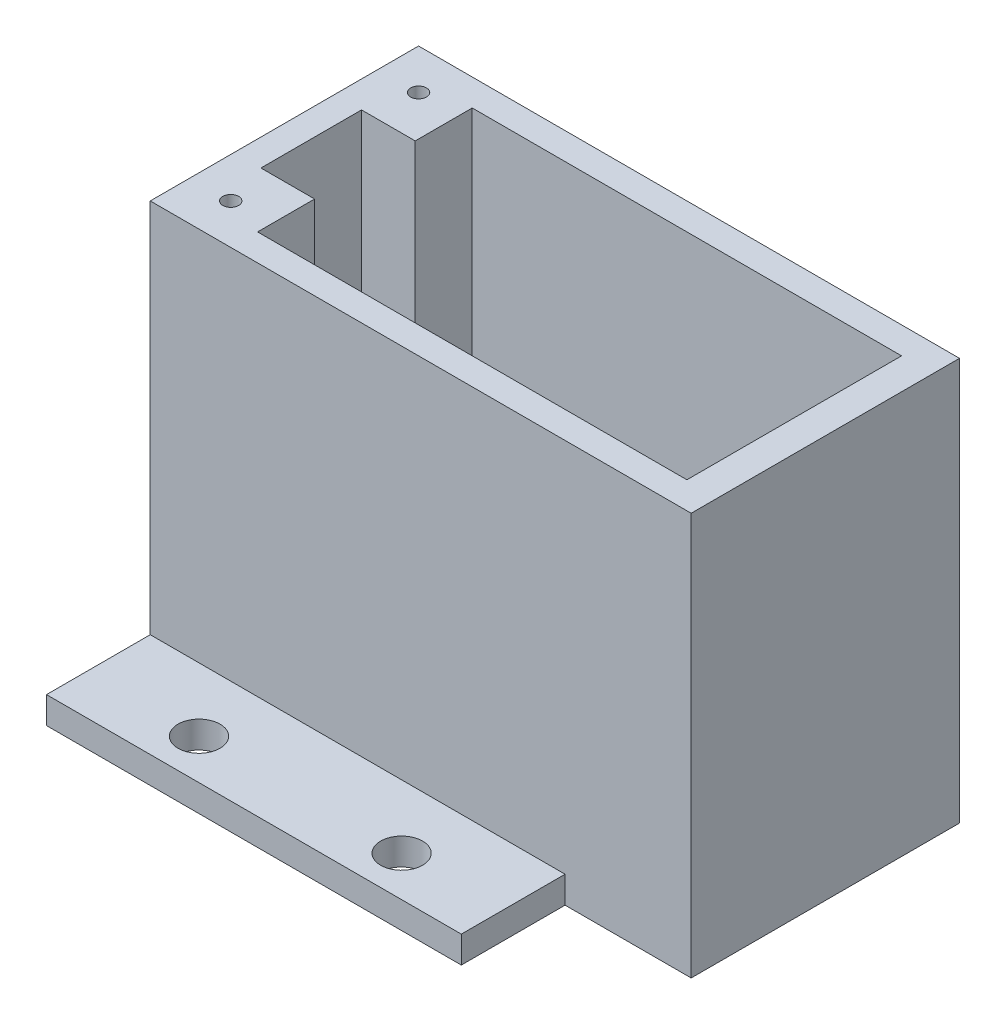
ISO-10303-21;
HEADER;
FILE_DESCRIPTION(('STEP AP214'),'2;1');
FILE_NAME('part.step','',(''),(''),'','','');
FILE_SCHEMA(('AUTOMOTIVE_DESIGN { 1 0 10303 214 1 1 1 1 }'));
ENDSEC;
DATA;
#1=APPLICATION_CONTEXT('core data for automotive mechanical design processes');
#2=APPLICATION_PROTOCOL_DEFINITION('international standard','automotive_design',2000,#1);
#3=PRODUCT_CONTEXT('',#1,'mechanical');
#4=PRODUCT('Part','Part','',(#3));
#5=PRODUCT_RELATED_PRODUCT_CATEGORY('part','',(#4));
#6=PRODUCT_DEFINITION_FORMATION('','',#4);
#7=PRODUCT_DEFINITION_CONTEXT('part definition',#1,'design');
#8=PRODUCT_DEFINITION('design','',#6,#7);
#9=PRODUCT_DEFINITION_SHAPE('','',#8);
#10=(LENGTH_UNIT() NAMED_UNIT(*) SI_UNIT(.MILLI.,.METRE.));
#11=(NAMED_UNIT(*) PLANE_ANGLE_UNIT() SI_UNIT($,.RADIAN.));
#12=(NAMED_UNIT(*) SI_UNIT($,.STERADIAN.) SOLID_ANGLE_UNIT());
#13=UNCERTAINTY_MEASURE_WITH_UNIT(LENGTH_MEASURE(1.E-05),#10,'distance_accuracy_value','');
#14=(GEOMETRIC_REPRESENTATION_CONTEXT(3) GLOBAL_UNCERTAINTY_ASSIGNED_CONTEXT((#13)) GLOBAL_UNIT_ASSIGNED_CONTEXT((#10,
#11,#12)) REPRESENTATION_CONTEXT('',''));
#15=CARTESIAN_POINT('',(0.,0.,0.));
#16=DIRECTION('',(0.,0.,1.));
#17=DIRECTION('',(1.,0.,0.));
#18=AXIS2_PLACEMENT_3D('',#15,#16,#17);
#19=CARTESIAN_POINT('',(0.,5.08,0.));
#20=DIRECTION('',(0.,1.,0.));
#21=DIRECTION('',(0.,0.,1.));
#22=AXIS2_PLACEMENT_3D('',#19,#20,#21);
#23=PLANE('',#22);
#24=DIRECTION('',(0.,0.,-1.));
#25=VECTOR('',#24,1.);
#26=CARTESIAN_POINT('',(-32.941,5.08,45.));
#27=LINE('',#26,#25);
#28=CARTESIAN_POINT('',(-32.941,5.08,45.));
#29=VERTEX_POINT('',#28);
#30=CARTESIAN_POINT('',(-32.941,5.08,25.358));
#31=VERTEX_POINT('',#30);
#32=EDGE_CURVE('E234',#29,#31,#27,.T.);
#33=ORIENTED_EDGE('',*,*,#32,.F.);
#34=DIRECTION('',(1.,0.,0.));
#35=VECTOR('',#34,1.);
#36=CARTESIAN_POINT('',(45.593,5.08,45.));
#37=LINE('',#36,#35);
#38=CARTESIAN_POINT('',(45.593,5.08,45.));
#39=VERTEX_POINT('',#38);
#40=EDGE_CURVE('E99',#29,#39,#37,.T.);
#41=ORIENTED_EDGE('',*,*,#40,.T.);
#42=DIRECTION('',(0.,0.,-1.));
#43=VECTOR('',#42,1.);
#44=CARTESIAN_POINT('',(45.593,5.08,45.));
#45=LINE('',#44,#43);
#46=CARTESIAN_POINT('',(45.593,5.08,25.358));
#47=VERTEX_POINT('',#46);
#48=EDGE_CURVE('E107',#39,#47,#45,.T.);
#49=ORIENTED_EDGE('',*,*,#48,.T.);
#50=DIRECTION('',(1.,0.,0.));
#51=VECTOR('',#50,1.);
#52=CARTESIAN_POINT('',(69.469,5.08,25.358));
#53=LINE('',#52,#51);
#54=EDGE_CURVE('E146',#31,#47,#53,.T.);
#55=ORIENTED_EDGE('',*,*,#54,.F.);
#56=EDGE_LOOP('',(#33,#41,#49,#55));
#57=FACE_BOUND('',#56,.T.);
#58=CARTESIAN_POINT('',(-11.684,5.08,37.38));
#59=DIRECTION('',(0.,1.,0.));
#60=DIRECTION('',(0.,0.,1.));
#61=AXIS2_PLACEMENT_3D('',#58,#59,#60);
#62=CIRCLE('',#61,3.96875);
#63=CARTESIAN_POINT('',(-11.684,5.08,41.34875));
#64=VERTEX_POINT('',#63);
#65=EDGE_CURVE('E113',#64,#64,#62,.T.);
#66=ORIENTED_EDGE('',*,*,#65,.F.);
#67=EDGE_LOOP('',(#66));
#68=FACE_BOUND('',#67,.T.);
#69=CARTESIAN_POINT('',(26.67,5.08,37.38));
#70=DIRECTION('',(0.,1.,0.));
#71=DIRECTION('',(0.,0.,1.));
#72=AXIS2_PLACEMENT_3D('',#69,#70,#71);
#73=CIRCLE('',#72,3.96875);
#74=CARTESIAN_POINT('',(26.67,5.08,41.34875));
#75=VERTEX_POINT('',#74);
#76=EDGE_CURVE('E105',#75,#75,#73,.T.);
#77=ORIENTED_EDGE('',*,*,#76,.F.);
#78=EDGE_LOOP('',(#77));
#79=FACE_BOUND('',#78,.T.);
#80=ADVANCED_FACE('F33',(#57,#68,#79),#23,.T.);
#81=CARTESIAN_POINT('',(45.593,5.08,45.));
#82=DIRECTION('',(-1.,0.,0.));
#83=DIRECTION('',(0.,0.,1.));
#84=AXIS2_PLACEMENT_3D('',#81,#82,#83);
#85=PLANE('',#84);
#86=DIRECTION('',(0.,1.,0.));
#87=VECTOR('',#86,1.);
#88=CARTESIAN_POINT('',(45.593,0.,25.358));
#89=LINE('',#88,#87);
#90=CARTESIAN_POINT('',(45.593,0.,25.358));
#91=VERTEX_POINT('',#90);
#92=EDGE_CURVE('E205',#91,#47,#89,.T.);
#93=ORIENTED_EDGE('',*,*,#92,.T.);
#94=ORIENTED_EDGE('',*,*,#48,.F.);
#95=DIRECTION('',(0.,-1.,0.));
#96=VECTOR('',#95,1.);
#97=CARTESIAN_POINT('',(45.593,5.08,45.));
#98=LINE('',#97,#96);
#99=CARTESIAN_POINT('',(45.593,0.,45.));
#100=VERTEX_POINT('',#99);
#101=EDGE_CURVE('E37',#39,#100,#98,.T.);
#102=ORIENTED_EDGE('',*,*,#101,.T.);
#103=DIRECTION('',(0.,0.,-1.));
#104=VECTOR('',#103,1.);
#105=CARTESIAN_POINT('',(45.593,0.,45.));
#106=LINE('',#105,#104);
#107=EDGE_CURVE('E83',#100,#91,#106,.T.);
#108=ORIENTED_EDGE('',*,*,#107,.T.);
#109=EDGE_LOOP('',(#93,#94,#102,#108));
#110=FACE_BOUND('',#109,.T.);
#111=ADVANCED_FACE('F357',(#110),#85,.F.);
#112=DIRECTION('',(0.,1.,0.));
#113=VECTOR('',#112,1.);
#114=CARTESIAN_POINT('',(45.593,0.,-25.442));
#115=LINE('',#114,#113);
#116=CARTESIAN_POINT('',(45.593,0.,-25.442));
#117=VERTEX_POINT('',#116);
#118=CARTESIAN_POINT('',(45.593,5.08,-25.442));
#119=VERTEX_POINT('',#118);
#120=EDGE_CURVE('E79',#117,#119,#115,.T.);
#121=ORIENTED_EDGE('',*,*,#120,.F.);
#122=CARTESIAN_POINT('',(45.593,0.,-45.));
#123=VERTEX_POINT('',#122);
#124=EDGE_CURVE('E72',#117,#123,#106,.T.);
#125=ORIENTED_EDGE('',*,*,#124,.T.);
#126=DIRECTION('',(0.,-1.,0.));
#127=VECTOR('',#126,1.);
#128=CARTESIAN_POINT('',(45.593,5.08,-45.));
#129=LINE('',#128,#127);
#130=CARTESIAN_POINT('',(45.593,5.08,-45.));
#131=VERTEX_POINT('',#130);
#132=EDGE_CURVE('E75',#131,#123,#129,.T.);
#133=ORIENTED_EDGE('',*,*,#132,.F.);
#134=EDGE_CURVE('E58',#119,#131,#45,.T.);
#135=ORIENTED_EDGE('',*,*,#134,.F.);
#136=EDGE_LOOP('',(#121,#125,#133,#135));
#137=FACE_BOUND('',#136,.T.);
#138=ADVANCED_FACE('F74',(#137),#85,.F.);
#139=CARTESIAN_POINT('',(-32.941,5.08,-25.442));
#140=VERTEX_POINT('',#139);
#141=CARTESIAN_POINT('',(-32.941,5.08,-45.));
#142=VERTEX_POINT('',#141);
#143=EDGE_CURVE('E237',#140,#142,#27,.T.);
#144=ORIENTED_EDGE('',*,*,#143,.F.);
#145=DIRECTION('',(-1.,0.,0.));
#146=VECTOR('',#145,1.);
#147=CARTESIAN_POINT('',(69.469,5.08,-25.442));
#148=LINE('',#147,#146);
#149=EDGE_CURVE('E11',#119,#140,#148,.T.);
#150=ORIENTED_EDGE('',*,*,#149,.F.);
#151=ORIENTED_EDGE('',*,*,#134,.T.);
#152=DIRECTION('',(-1.,0.,0.));
#153=VECTOR('',#152,1.);
#154=CARTESIAN_POINT('',(45.593,5.08,-45.));
#155=LINE('',#154,#153);
#156=EDGE_CURVE('E92',#131,#142,#155,.T.);
#157=ORIENTED_EDGE('',*,*,#156,.T.);
#158=EDGE_LOOP('',(#144,#150,#151,#157));
#159=FACE_BOUND('',#158,.T.);
#160=CARTESIAN_POINT('',(-11.684,5.08,-37.38));
#161=DIRECTION('',(0.,1.,0.));
#162=DIRECTION('',(0.,0.,1.));
#163=AXIS2_PLACEMENT_3D('',#160,#161,#162);
#164=CIRCLE('',#163,3.96875);
#165=CARTESIAN_POINT('',(-11.684,5.08,-33.41125));
#166=VERTEX_POINT('',#165);
#167=EDGE_CURVE('E119',#166,#166,#164,.T.);
#168=ORIENTED_EDGE('',*,*,#167,.F.);
#169=EDGE_LOOP('',(#168));
#170=FACE_BOUND('',#169,.T.);
#171=CARTESIAN_POINT('',(26.67,5.08,-37.38));
#172=DIRECTION('',(0.,1.,0.));
#173=DIRECTION('',(0.,0.,1.));
#174=AXIS2_PLACEMENT_3D('',#171,#172,#173);
#175=CIRCLE('',#174,3.96875);
#176=CARTESIAN_POINT('',(26.67,5.08,-33.41125));
#177=VERTEX_POINT('',#176);
#178=EDGE_CURVE('E125',#177,#177,#175,.T.);
#179=ORIENTED_EDGE('',*,*,#178,.F.);
#180=EDGE_LOOP('',(#179));
#181=FACE_BOUND('',#180,.T.);
#182=ADVANCED_FACE('F332',(#159,#170,#181),#23,.T.);
#183=CARTESIAN_POINT('',(0.,0.,0.));
#184=DIRECTION('',(0.,1.,0.));
#185=DIRECTION('',(0.,0.,1.));
#186=AXIS2_PLACEMENT_3D('',#183,#184,#185);
#187=PLANE('',#186);
#188=DIRECTION('',(0.,0.,-1.));
#189=VECTOR('',#188,1.);
#190=CARTESIAN_POINT('',(63.579,0.,20.278));
#191=LINE('',#190,#189);
#192=CARTESIAN_POINT('',(63.579,0.,20.278));
#193=VERTEX_POINT('',#192);
#194=CARTESIAN_POINT('',(63.579,0.,-20.362));
#195=VERTEX_POINT('',#194);
#196=EDGE_CURVE('E239',#193,#195,#191,.T.);
#197=ORIENTED_EDGE('',*,*,#196,.T.);
#198=DIRECTION('',(-1.,0.,0.));
#199=VECTOR('',#198,1.);
#200=CARTESIAN_POINT('',(63.579,0.,-20.362));
#201=LINE('',#200,#199);
#202=CARTESIAN_POINT('',(-17.701,0.,-20.362));
#203=VERTEX_POINT('',#202);
#204=EDGE_CURVE('E260',#195,#203,#201,.T.);
#205=ORIENTED_EDGE('',*,*,#204,.T.);
#206=DIRECTION('',(0.,0.,1.));
#207=VECTOR('',#206,1.);
#208=CARTESIAN_POINT('',(-17.701,0.,-20.362));
#209=LINE('',#208,#207);
#210=CARTESIAN_POINT('',(-17.701,0.,-9.56699999999999));
#211=VERTEX_POINT('',#210);
#212=EDGE_CURVE('E257',#203,#211,#209,.T.);
#213=ORIENTED_EDGE('',*,*,#212,.T.);
#214=DIRECTION('',(-1.,0.,0.));
#215=VECTOR('',#214,1.);
#216=CARTESIAN_POINT('',(-17.701,0.,-9.56699999999999));
#217=LINE('',#216,#215);
#218=CARTESIAN_POINT('',(-27.861,0.,-9.56699999999999));
#219=VERTEX_POINT('',#218);
#220=EDGE_CURVE('E254',#211,#219,#217,.T.);
#221=ORIENTED_EDGE('',*,*,#220,.T.);
#222=DIRECTION('',(0.,0.,1.));
#223=VECTOR('',#222,1.);
#224=CARTESIAN_POINT('',(-27.861,0.,-9.56699999999999));
#225=LINE('',#224,#223);
#226=CARTESIAN_POINT('',(-27.861,0.,9.48300000000002));
#227=VERTEX_POINT('',#226);
#228=EDGE_CURVE('E251',#219,#227,#225,.T.);
#229=ORIENTED_EDGE('',*,*,#228,.T.);
#230=DIRECTION('',(1.,0.,0.));
#231=VECTOR('',#230,1.);
#232=CARTESIAN_POINT('',(-27.861,0.,9.48300000000002));
#233=LINE('',#232,#231);
#234=CARTESIAN_POINT('',(-17.701,0.,9.48300000000001));
#235=VERTEX_POINT('',#234);
#236=EDGE_CURVE('E248',#227,#235,#233,.T.);
#237=ORIENTED_EDGE('',*,*,#236,.T.);
#238=DIRECTION('',(0.,0.,1.));
#239=VECTOR('',#238,1.);
#240=CARTESIAN_POINT('',(-17.701,0.,9.48300000000001));
#241=LINE('',#240,#239);
#242=CARTESIAN_POINT('',(-17.701,0.,20.278));
#243=VERTEX_POINT('',#242);
#244=EDGE_CURVE('E245',#235,#243,#241,.T.);
#245=ORIENTED_EDGE('',*,*,#244,.T.);
#246=DIRECTION('',(1.,0.,0.));
#247=VECTOR('',#246,1.);
#248=CARTESIAN_POINT('',(-17.701,0.,20.278));
#249=LINE('',#248,#247);
#250=EDGE_CURVE('E242',#243,#193,#249,.T.);
#251=ORIENTED_EDGE('',*,*,#250,.T.);
#252=EDGE_LOOP('',(#197,#205,#213,#221,#229,#237,#245,#251));
#253=FACE_BOUND('',#252,.T.);
#254=DIRECTION('',(1.,0.,0.));
#255=VECTOR('',#254,1.);
#256=CARTESIAN_POINT('',(45.593,0.,45.));
#257=LINE('',#256,#255);
#258=CARTESIAN_POINT('',(-32.941,0.,45.));
#259=VERTEX_POINT('',#258);
#260=EDGE_CURVE('E84',#259,#100,#257,.T.);
#261=ORIENTED_EDGE('',*,*,#260,.F.);
#262=DIRECTION('',(0.,0.,-1.));
#263=VECTOR('',#262,1.);
#264=CARTESIAN_POINT('',(-32.941,0.,45.));
#265=LINE('',#264,#263);
#266=CARTESIAN_POINT('',(-32.941,0.,-45.));
#267=VERTEX_POINT('',#266);
#268=EDGE_CURVE('E98',#259,#267,#265,.T.);
#269=ORIENTED_EDGE('',*,*,#268,.T.);
#270=DIRECTION('',(-1.,0.,0.));
#271=VECTOR('',#270,1.);
#272=CARTESIAN_POINT('',(45.593,0.,-45.));
#273=LINE('',#272,#271);
#274=EDGE_CURVE('E91',#123,#267,#273,.T.);
#275=ORIENTED_EDGE('',*,*,#274,.F.);
#276=ORIENTED_EDGE('',*,*,#124,.F.);
#277=DIRECTION('',(1.,0.,0.));
#278=VECTOR('',#277,1.);
#279=CARTESIAN_POINT('',(69.469,0.,-25.442));
#280=LINE('',#279,#278);
#281=CARTESIAN_POINT('',(69.469,0.,-25.442));
#282=VERTEX_POINT('',#281);
#283=EDGE_CURVE('E209',#117,#282,#280,.T.);
#284=ORIENTED_EDGE('',*,*,#283,.T.);
#285=DIRECTION('',(0.,0.,1.));
#286=VECTOR('',#285,1.);
#287=CARTESIAN_POINT('',(69.469,0.,-25.442));
#288=LINE('',#287,#286);
#289=CARTESIAN_POINT('',(69.469,0.,25.358));
#290=VERTEX_POINT('',#289);
#291=EDGE_CURVE('E214',#282,#290,#288,.T.);
#292=ORIENTED_EDGE('',*,*,#291,.T.);
#293=DIRECTION('',(-1.,0.,0.));
#294=VECTOR('',#293,1.);
#295=CARTESIAN_POINT('',(69.469,0.,25.358));
#296=LINE('',#295,#294);
#297=EDGE_CURVE('E211',#290,#91,#296,.T.);
#298=ORIENTED_EDGE('',*,*,#297,.T.);
#299=ORIENTED_EDGE('',*,*,#107,.F.);
#300=EDGE_LOOP('',(#261,#269,#275,#276,#284,#292,#298,#299));
#301=FACE_BOUND('',#300,.T.);
#302=CARTESIAN_POINT('',(26.67,0.,37.38));
#303=DIRECTION('',(0.,1.,0.));
#304=DIRECTION('',(0.,0.,1.));
#305=AXIS2_PLACEMENT_3D('',#302,#303,#304);
#306=CIRCLE('',#305,3.96875);
#307=CARTESIAN_POINT('',(26.67,0.,41.34875));
#308=VERTEX_POINT('',#307);
#309=EDGE_CURVE('E110',#308,#308,#306,.T.);
#310=ORIENTED_EDGE('',*,*,#309,.T.);
#311=EDGE_LOOP('',(#310));
#312=FACE_BOUND('',#311,.T.);
#313=CARTESIAN_POINT('',(-11.684,0.,37.38));
#314=DIRECTION('',(0.,1.,0.));
#315=DIRECTION('',(0.,0.,1.));
#316=AXIS2_PLACEMENT_3D('',#313,#314,#315);
#317=CIRCLE('',#316,3.96875);
#318=CARTESIAN_POINT('',(-11.684,0.,41.34875));
#319=VERTEX_POINT('',#318);
#320=EDGE_CURVE('E116',#319,#319,#317,.T.);
#321=ORIENTED_EDGE('',*,*,#320,.T.);
#322=EDGE_LOOP('',(#321));
#323=FACE_BOUND('',#322,.T.);
#324=CARTESIAN_POINT('',(-11.684,0.,-37.38));
#325=DIRECTION('',(0.,1.,0.));
#326=DIRECTION('',(0.,0.,1.));
#327=AXIS2_PLACEMENT_3D('',#324,#325,#326);
#328=CIRCLE('',#327,3.96875);
#329=CARTESIAN_POINT('',(-11.684,0.,-33.41125));
#330=VERTEX_POINT('',#329);
#331=EDGE_CURVE('E122',#330,#330,#328,.T.);
#332=ORIENTED_EDGE('',*,*,#331,.T.);
#333=EDGE_LOOP('',(#332));
#334=FACE_BOUND('',#333,.T.);
#335=CARTESIAN_POINT('',(26.67,0.,-37.38));
#336=DIRECTION('',(0.,1.,0.));
#337=DIRECTION('',(0.,0.,1.));
#338=AXIS2_PLACEMENT_3D('',#335,#336,#337);
#339=CIRCLE('',#338,3.96875);
#340=CARTESIAN_POINT('',(26.67,0.,-33.41125));
#341=VERTEX_POINT('',#340);
#342=EDGE_CURVE('E128',#341,#341,#339,.T.);
#343=ORIENTED_EDGE('',*,*,#342,.T.);
#344=EDGE_LOOP('',(#343));
#345=FACE_BOUND('',#344,.T.);
#346=ADVANCED_FACE('F95',(#253,#301,#312,#323,#334,#345),#187,.F.);
#347=CARTESIAN_POINT('',(45.593,5.08,45.));
#348=DIRECTION('',(0.,0.,-1.));
#349=DIRECTION('',(-1.,0.,0.));
#350=AXIS2_PLACEMENT_3D('',#347,#348,#349);
#351=PLANE('',#350);
#352=ORIENTED_EDGE('',*,*,#40,.F.);
#353=DIRECTION('',(0.,1.,0.));
#354=VECTOR('',#353,1.);
#355=CARTESIAN_POINT('',(-32.941,0.,45.));
#356=LINE('',#355,#354);
#357=EDGE_CURVE('E230',#259,#29,#356,.T.);
#358=ORIENTED_EDGE('',*,*,#357,.F.);
#359=ORIENTED_EDGE('',*,*,#260,.T.);
#360=ORIENTED_EDGE('',*,*,#101,.F.);
#361=EDGE_LOOP('',(#352,#358,#359,#360));
#362=FACE_BOUND('',#361,.T.);
#363=ADVANCED_FACE('F35',(#362),#351,.F.);
#364=CARTESIAN_POINT('',(45.593,5.08,-45.));
#365=DIRECTION('',(0.,0.,1.));
#366=DIRECTION('',(1.,0.,0.));
#367=AXIS2_PLACEMENT_3D('',#364,#365,#366);
#368=PLANE('',#367);
#369=ORIENTED_EDGE('',*,*,#274,.T.);
#370=DIRECTION('',(0.,1.,0.));
#371=VECTOR('',#370,1.);
#372=CARTESIAN_POINT('',(-32.941,0.,-45.));
#373=LINE('',#372,#371);
#374=EDGE_CURVE('E222',#267,#142,#373,.T.);
#375=ORIENTED_EDGE('',*,*,#374,.T.);
#376=ORIENTED_EDGE('',*,*,#156,.F.);
#377=ORIENTED_EDGE('',*,*,#132,.T.);
#378=EDGE_LOOP('',(#369,#375,#376,#377));
#379=FACE_BOUND('',#378,.T.);
#380=ADVANCED_FACE('F88',(#379),#368,.F.);
#381=CARTESIAN_POINT('',(26.67,5.08,37.38));
#382=DIRECTION('',(0.,-1.,0.));
#383=DIRECTION('',(0.,0.,-1.));
#384=AXIS2_PLACEMENT_3D('',#381,#382,#383);
#385=CYLINDRICAL_SURFACE('',#384,3.96875);
#386=ORIENTED_EDGE('',*,*,#76,.T.);
#387=EDGE_LOOP('',(#386));
#388=FACE_BOUND('',#387,.T.);
#389=ORIENTED_EDGE('',*,*,#309,.F.);
#390=EDGE_LOOP('',(#389));
#391=FACE_BOUND('',#390,.T.);
#392=ADVANCED_FACE('F371',(#388,#391),#385,.F.);
#393=CARTESIAN_POINT('',(-11.684,5.08,37.38));
#394=DIRECTION('',(0.,-1.,0.));
#395=DIRECTION('',(0.,0.,-1.));
#396=AXIS2_PLACEMENT_3D('',#393,#394,#395);
#397=CYLINDRICAL_SURFACE('',#396,3.96875);
#398=ORIENTED_EDGE('',*,*,#65,.T.);
#399=EDGE_LOOP('',(#398));
#400=FACE_BOUND('',#399,.T.);
#401=ORIENTED_EDGE('',*,*,#320,.F.);
#402=EDGE_LOOP('',(#401));
#403=FACE_BOUND('',#402,.T.);
#404=ADVANCED_FACE('F374',(#400,#403),#397,.F.);
#405=CARTESIAN_POINT('',(-11.684,5.08,-37.38));
#406=DIRECTION('',(0.,-1.,0.));
#407=DIRECTION('',(0.,0.,-1.));
#408=AXIS2_PLACEMENT_3D('',#405,#406,#407);
#409=CYLINDRICAL_SURFACE('',#408,3.96875);
#410=ORIENTED_EDGE('',*,*,#167,.T.);
#411=EDGE_LOOP('',(#410));
#412=FACE_BOUND('',#411,.T.);
#413=ORIENTED_EDGE('',*,*,#331,.F.);
#414=EDGE_LOOP('',(#413));
#415=FACE_BOUND('',#414,.T.);
#416=ADVANCED_FACE('F388',(#412,#415),#409,.F.);
#417=CARTESIAN_POINT('',(26.67,5.08,-37.38));
#418=DIRECTION('',(0.,-1.,0.));
#419=DIRECTION('',(0.,0.,-1.));
#420=AXIS2_PLACEMENT_3D('',#417,#418,#419);
#421=CYLINDRICAL_SURFACE('',#420,3.96875);
#422=ORIENTED_EDGE('',*,*,#178,.T.);
#423=EDGE_LOOP('',(#422));
#424=FACE_BOUND('',#423,.T.);
#425=ORIENTED_EDGE('',*,*,#342,.F.);
#426=EDGE_LOOP('',(#425));
#427=FACE_BOUND('',#426,.T.);
#428=ADVANCED_FACE('F386',(#424,#427),#421,.F.);
#429=CARTESIAN_POINT('',(0.,76.2,0.));
#430=DIRECTION('',(0.,1.,0.));
#431=DIRECTION('',(0.,0.,1.));
#432=AXIS2_PLACEMENT_3D('',#429,#430,#431);
#433=PLANE('',#432);
#434=CARTESIAN_POINT('',(-25.321,76.2,-17.822));
#435=DIRECTION('',(0.,1.,0.));
#436=DIRECTION('',(0.,0.,1.));
#437=AXIS2_PLACEMENT_3D('',#434,#435,#436);
#438=CIRCLE('',#437,1.5);
#439=CARTESIAN_POINT('',(-25.321,76.2,-16.322));
#440=VERTEX_POINT('',#439);
#441=EDGE_CURVE('E225',#440,#440,#438,.T.);
#442=ORIENTED_EDGE('',*,*,#441,.F.);
#443=EDGE_LOOP('',(#442));
#444=FACE_BOUND('',#443,.T.);
#445=CARTESIAN_POINT('',(-25.321,76.2,17.738));
#446=DIRECTION('',(0.,1.,0.));
#447=DIRECTION('',(0.,0.,1.));
#448=AXIS2_PLACEMENT_3D('',#445,#446,#447);
#449=CIRCLE('',#448,1.5);
#450=CARTESIAN_POINT('',(-25.321,76.2,19.238));
#451=VERTEX_POINT('',#450);
#452=EDGE_CURVE('E218',#451,#451,#449,.T.);
#453=ORIENTED_EDGE('',*,*,#452,.F.);
#454=EDGE_LOOP('',(#453));
#455=FACE_BOUND('',#454,.T.);
#456=DIRECTION('',(0.,0.,1.));
#457=VECTOR('',#456,1.);
#458=CARTESIAN_POINT('',(-32.941,76.2,25.358));
#459=LINE('',#458,#457);
#460=CARTESIAN_POINT('',(-32.941,76.2,-25.442));
#461=VERTEX_POINT('',#460);
#462=CARTESIAN_POINT('',(-32.941,76.2,25.358));
#463=VERTEX_POINT('',#462);
#464=EDGE_CURVE('E149',#461,#463,#459,.T.);
#465=ORIENTED_EDGE('',*,*,#464,.T.);
#466=DIRECTION('',(1.,0.,0.));
#467=VECTOR('',#466,1.);
#468=CARTESIAN_POINT('',(69.469,76.2,25.358));
#469=LINE('',#468,#467);
#470=CARTESIAN_POINT('',(69.469,76.2,25.358));
#471=VERTEX_POINT('',#470);
#472=EDGE_CURVE('E156',#463,#471,#469,.T.);
#473=ORIENTED_EDGE('',*,*,#472,.T.);
#474=DIRECTION('',(0.,0.,-1.));
#475=VECTOR('',#474,1.);
#476=CARTESIAN_POINT('',(69.469,76.2,25.358));
#477=LINE('',#476,#475);
#478=CARTESIAN_POINT('',(69.469,76.2,-25.442));
#479=VERTEX_POINT('',#478);
#480=EDGE_CURVE('E153',#471,#479,#477,.T.);
#481=ORIENTED_EDGE('',*,*,#480,.T.);
#482=DIRECTION('',(-1.,0.,0.));
#483=VECTOR('',#482,1.);
#484=CARTESIAN_POINT('',(69.469,76.2,-25.442));
#485=LINE('',#484,#483);
#486=EDGE_CURVE('E144',#479,#461,#485,.T.);
#487=ORIENTED_EDGE('',*,*,#486,.T.);
#488=EDGE_LOOP('',(#465,#473,#481,#487));
#489=FACE_BOUND('',#488,.T.);
#490=DIRECTION('',(1.,0.,0.));
#491=VECTOR('',#490,1.);
#492=CARTESIAN_POINT('',(-17.701,76.2,9.48300000000001));
#493=LINE('',#492,#491);
#494=CARTESIAN_POINT('',(-27.861,76.2,9.48300000000002));
#495=VERTEX_POINT('',#494);
#496=CARTESIAN_POINT('',(-17.701,76.2,9.48300000000001));
#497=VERTEX_POINT('',#496);
#498=EDGE_CURVE('E199',#495,#497,#493,.T.);
#499=ORIENTED_EDGE('',*,*,#498,.F.);
#500=DIRECTION('',(0.,0.,1.));
#501=VECTOR('',#500,1.);
#502=CARTESIAN_POINT('',(-27.861,76.2,9.48300000000002));
#503=LINE('',#502,#501);
#504=CARTESIAN_POINT('',(-27.861,76.2,-9.56699999999999));
#505=VERTEX_POINT('',#504);
#506=EDGE_CURVE('E202',#505,#495,#503,.T.);
#507=ORIENTED_EDGE('',*,*,#506,.F.);
#508=DIRECTION('',(-1.,0.,0.));
#509=VECTOR('',#508,1.);
#510=CARTESIAN_POINT('',(-17.701,76.2,-9.56699999999999));
#511=LINE('',#510,#509);
#512=CARTESIAN_POINT('',(-17.701,76.2,-9.56699999999999));
#513=VERTEX_POINT('',#512);
#514=EDGE_CURVE('E182',#513,#505,#511,.T.);
#515=ORIENTED_EDGE('',*,*,#514,.F.);
#516=DIRECTION('',(0.,0.,1.));
#517=VECTOR('',#516,1.);
#518=CARTESIAN_POINT('',(-17.701,76.2,-9.56699999999999));
#519=LINE('',#518,#517);
#520=CARTESIAN_POINT('',(-17.701,76.2,-20.362));
#521=VERTEX_POINT('',#520);
#522=EDGE_CURVE('E185',#521,#513,#519,.T.);
#523=ORIENTED_EDGE('',*,*,#522,.F.);
#524=DIRECTION('',(-1.,0.,0.));
#525=VECTOR('',#524,1.);
#526=CARTESIAN_POINT('',(-17.701,76.2,-20.362));
#527=LINE('',#526,#525);
#528=CARTESIAN_POINT('',(63.579,76.2,-20.362));
#529=VERTEX_POINT('',#528);
#530=EDGE_CURVE('E187',#529,#521,#527,.T.);
#531=ORIENTED_EDGE('',*,*,#530,.F.);
#532=DIRECTION('',(0.,0.,-1.));
#533=VECTOR('',#532,1.);
#534=CARTESIAN_POINT('',(63.579,76.2,9.483));
#535=LINE('',#534,#533);
#536=CARTESIAN_POINT('',(63.579,76.2,20.278));
#537=VERTEX_POINT('',#536);
#538=EDGE_CURVE('E190',#537,#529,#535,.T.);
#539=ORIENTED_EDGE('',*,*,#538,.F.);
#540=DIRECTION('',(1.,0.,0.));
#541=VECTOR('',#540,1.);
#542=CARTESIAN_POINT('',(-17.701,76.2,20.278));
#543=LINE('',#542,#541);
#544=CARTESIAN_POINT('',(-17.701,76.2,20.278));
#545=VERTEX_POINT('',#544);
#546=EDGE_CURVE('E193',#545,#537,#543,.T.);
#547=ORIENTED_EDGE('',*,*,#546,.F.);
#548=DIRECTION('',(0.,0.,1.));
#549=VECTOR('',#548,1.);
#550=CARTESIAN_POINT('',(-17.701,76.2,9.48300000000001));
#551=LINE('',#550,#549);
#552=EDGE_CURVE('E196',#497,#545,#551,.T.);
#553=ORIENTED_EDGE('',*,*,#552,.F.);
#554=EDGE_LOOP('',(#499,#507,#515,#523,#531,#539,#547,#553));
#555=FACE_BOUND('',#554,.T.);
#556=ADVANCED_FACE('F341',(#444,#455,#489,#555),#433,.T.);
#557=CARTESIAN_POINT('',(-32.941,76.2,25.358));
#558=DIRECTION('',(1.,0.,0.));
#559=DIRECTION('',(0.,0.,-1.));
#560=AXIS2_PLACEMENT_3D('',#557,#558,#559);
#561=PLANE('',#560);
#562=DIRECTION('',(0.,-1.,0.));
#563=VECTOR('',#562,1.);
#564=CARTESIAN_POINT('',(-32.941,76.2,-25.442));
#565=LINE('',#564,#563);
#566=EDGE_CURVE('E142',#461,#140,#565,.T.);
#567=ORIENTED_EDGE('',*,*,#566,.T.);
#568=ORIENTED_EDGE('',*,*,#143,.T.);
#569=ORIENTED_EDGE('',*,*,#374,.F.);
#570=ORIENTED_EDGE('',*,*,#268,.F.);
#571=ORIENTED_EDGE('',*,*,#357,.T.);
#572=ORIENTED_EDGE('',*,*,#32,.T.);
#573=DIRECTION('',(0.,-1.,0.));
#574=VECTOR('',#573,1.);
#575=CARTESIAN_POINT('',(-32.941,76.2,25.358));
#576=LINE('',#575,#574);
#577=EDGE_CURVE('E131',#463,#31,#576,.T.);
#578=ORIENTED_EDGE('',*,*,#577,.F.);
#579=ORIENTED_EDGE('',*,*,#464,.F.);
#580=EDGE_LOOP('',(#567,#568,#569,#570,#571,#572,#578,#579));
#581=FACE_BOUND('',#580,.T.);
#582=ADVANCED_FACE('F335',(#581),#561,.F.);
#583=CARTESIAN_POINT('',(69.469,76.2,25.358));
#584=DIRECTION('',(0.,0.,-1.));
#585=DIRECTION('',(-1.,0.,0.));
#586=AXIS2_PLACEMENT_3D('',#583,#584,#585);
#587=PLANE('',#586);
#588=ORIENTED_EDGE('',*,*,#54,.T.);
#589=ORIENTED_EDGE('',*,*,#92,.F.);
#590=ORIENTED_EDGE('',*,*,#297,.F.);
#591=DIRECTION('',(0.,-1.,0.));
#592=VECTOR('',#591,1.);
#593=CARTESIAN_POINT('',(69.469,76.2,25.358));
#594=LINE('',#593,#592);
#595=EDGE_CURVE('E136',#471,#290,#594,.T.);
#596=ORIENTED_EDGE('',*,*,#595,.F.);
#597=ORIENTED_EDGE('',*,*,#472,.F.);
#598=ORIENTED_EDGE('',*,*,#577,.T.);
#599=EDGE_LOOP('',(#588,#589,#590,#596,#597,#598));
#600=FACE_BOUND('',#599,.T.);
#601=ADVANCED_FACE('F352',(#600),#587,.F.);
#602=CARTESIAN_POINT('',(69.469,76.2,25.358));
#603=DIRECTION('',(-1.,0.,0.));
#604=DIRECTION('',(0.,0.,1.));
#605=AXIS2_PLACEMENT_3D('',#602,#603,#604);
#606=PLANE('',#605);
#607=ORIENTED_EDGE('',*,*,#595,.T.);
#608=ORIENTED_EDGE('',*,*,#291,.F.);
#609=DIRECTION('',(0.,-1.,0.));
#610=VECTOR('',#609,1.);
#611=CARTESIAN_POINT('',(69.469,76.2,-25.442));
#612=LINE('',#611,#610);
#613=EDGE_CURVE('E139',#479,#282,#612,.T.);
#614=ORIENTED_EDGE('',*,*,#613,.F.);
#615=ORIENTED_EDGE('',*,*,#480,.F.);
#616=EDGE_LOOP('',(#607,#608,#614,#615));
#617=FACE_BOUND('',#616,.T.);
#618=ADVANCED_FACE('F347',(#617),#606,.F.);
#619=CARTESIAN_POINT('',(69.469,76.2,-25.442));
#620=DIRECTION('',(0.,0.,1.));
#621=DIRECTION('',(1.,0.,0.));
#622=AXIS2_PLACEMENT_3D('',#619,#620,#621);
#623=PLANE('',#622);
#624=ORIENTED_EDGE('',*,*,#613,.T.);
#625=ORIENTED_EDGE('',*,*,#283,.F.);
#626=ORIENTED_EDGE('',*,*,#120,.T.);
#627=ORIENTED_EDGE('',*,*,#149,.T.);
#628=ORIENTED_EDGE('',*,*,#566,.F.);
#629=ORIENTED_EDGE('',*,*,#486,.F.);
#630=EDGE_LOOP('',(#624,#625,#626,#627,#628,#629));
#631=FACE_BOUND('',#630,.T.);
#632=ADVANCED_FACE('F330',(#631),#623,.F.);
#633=CARTESIAN_POINT('',(-27.861,76.2,9.48300000000002));
#634=DIRECTION('',(1.,0.,0.));
#635=DIRECTION('',(0.,0.,-1.));
#636=AXIS2_PLACEMENT_3D('',#633,#634,#635);
#637=PLANE('',#636);
#638=DIRECTION('',(0.,-1.,0.));
#639=VECTOR('',#638,1.);
#640=CARTESIAN_POINT('',(-27.861,76.2,9.48300000000002));
#641=LINE('',#640,#639);
#642=EDGE_CURVE('E150',#495,#227,#641,.T.);
#643=ORIENTED_EDGE('',*,*,#642,.T.);
#644=ORIENTED_EDGE('',*,*,#228,.F.);
#645=DIRECTION('',(0.,-1.,0.));
#646=VECTOR('',#645,1.);
#647=CARTESIAN_POINT('',(-27.861,76.2,-9.56699999999999));
#648=LINE('',#647,#646);
#649=EDGE_CURVE('E179',#505,#219,#648,.T.);
#650=ORIENTED_EDGE('',*,*,#649,.F.);
#651=ORIENTED_EDGE('',*,*,#506,.T.);
#652=EDGE_LOOP('',(#643,#644,#650,#651));
#653=FACE_BOUND('',#652,.T.);
#654=ADVANCED_FACE('F494',(#653),#637,.T.);
#655=CARTESIAN_POINT('',(-17.701,76.2,9.48300000000001));
#656=DIRECTION('',(0.,0.,-1.));
#657=DIRECTION('',(-1.,0.,0.));
#658=AXIS2_PLACEMENT_3D('',#655,#656,#657);
#659=PLANE('',#658);
#660=DIRECTION('',(0.,-1.,0.));
#661=VECTOR('',#660,1.);
#662=CARTESIAN_POINT('',(-17.701,76.2,9.48300000000001));
#663=LINE('',#662,#661);
#664=EDGE_CURVE('E163',#497,#235,#663,.T.);
#665=ORIENTED_EDGE('',*,*,#664,.T.);
#666=ORIENTED_EDGE('',*,*,#236,.F.);
#667=ORIENTED_EDGE('',*,*,#642,.F.);
#668=ORIENTED_EDGE('',*,*,#498,.T.);
#669=EDGE_LOOP('',(#665,#666,#667,#668));
#670=FACE_BOUND('',#669,.T.);
#671=ADVANCED_FACE('F552',(#670),#659,.T.);
#672=CARTESIAN_POINT('',(-17.701,76.2,9.48300000000001));
#673=DIRECTION('',(1.,0.,0.));
#674=DIRECTION('',(0.,0.,-1.));
#675=AXIS2_PLACEMENT_3D('',#672,#673,#674);
#676=PLANE('',#675);
#677=DIRECTION('',(0.,-1.,0.));
#678=VECTOR('',#677,1.);
#679=CARTESIAN_POINT('',(-17.701,76.2,20.278));
#680=LINE('',#679,#678);
#681=EDGE_CURVE('E166',#545,#243,#680,.T.);
#682=ORIENTED_EDGE('',*,*,#681,.T.);
#683=ORIENTED_EDGE('',*,*,#244,.F.);
#684=ORIENTED_EDGE('',*,*,#664,.F.);
#685=ORIENTED_EDGE('',*,*,#552,.T.);
#686=EDGE_LOOP('',(#682,#683,#684,#685));
#687=FACE_BOUND('',#686,.T.);
#688=ADVANCED_FACE('F564',(#687),#676,.T.);
#689=CARTESIAN_POINT('',(-17.701,76.2,20.278));
#690=DIRECTION('',(0.,0.,-1.));
#691=DIRECTION('',(-1.,0.,0.));
#692=AXIS2_PLACEMENT_3D('',#689,#690,#691);
#693=PLANE('',#692);
#694=DIRECTION('',(0.,-1.,0.));
#695=VECTOR('',#694,1.);
#696=CARTESIAN_POINT('',(63.579,76.2,20.278));
#697=LINE('',#696,#695);
#698=EDGE_CURVE('E169',#537,#193,#697,.T.);
#699=ORIENTED_EDGE('',*,*,#698,.T.);
#700=ORIENTED_EDGE('',*,*,#250,.F.);
#701=ORIENTED_EDGE('',*,*,#681,.F.);
#702=ORIENTED_EDGE('',*,*,#546,.T.);
#703=EDGE_LOOP('',(#699,#700,#701,#702));
#704=FACE_BOUND('',#703,.T.);
#705=ADVANCED_FACE('F576',(#704),#693,.T.);
#706=CARTESIAN_POINT('',(63.579,76.2,-9.56699999999999));
#707=DIRECTION('',(-1.,0.,0.));
#708=DIRECTION('',(0.,0.,1.));
#709=AXIS2_PLACEMENT_3D('',#706,#707,#708);
#710=PLANE('',#709);
#711=DIRECTION('',(0.,-1.,0.));
#712=VECTOR('',#711,1.);
#713=CARTESIAN_POINT('',(63.579,76.2,-20.362));
#714=LINE('',#713,#712);
#715=EDGE_CURVE('E172',#529,#195,#714,.T.);
#716=ORIENTED_EDGE('',*,*,#715,.T.);
#717=ORIENTED_EDGE('',*,*,#196,.F.);
#718=ORIENTED_EDGE('',*,*,#698,.F.);
#719=ORIENTED_EDGE('',*,*,#538,.T.);
#720=EDGE_LOOP('',(#716,#717,#718,#719));
#721=FACE_BOUND('',#720,.T.);
#722=ADVANCED_FACE('F588',(#721),#710,.T.);
#723=CARTESIAN_POINT('',(-17.701,76.2,-20.362));
#724=DIRECTION('',(0.,0.,1.));
#725=DIRECTION('',(1.,0.,0.));
#726=AXIS2_PLACEMENT_3D('',#723,#724,#725);
#727=PLANE('',#726);
#728=DIRECTION('',(0.,-1.,0.));
#729=VECTOR('',#728,1.);
#730=CARTESIAN_POINT('',(-17.701,76.2,-20.362));
#731=LINE('',#730,#729);
#732=EDGE_CURVE('E175',#521,#203,#731,.T.);
#733=ORIENTED_EDGE('',*,*,#732,.T.);
#734=ORIENTED_EDGE('',*,*,#204,.F.);
#735=ORIENTED_EDGE('',*,*,#715,.F.);
#736=ORIENTED_EDGE('',*,*,#530,.T.);
#737=EDGE_LOOP('',(#733,#734,#735,#736));
#738=FACE_BOUND('',#737,.T.);
#739=ADVANCED_FACE('F271',(#738),#727,.T.);
#740=CARTESIAN_POINT('',(-17.701,76.2,-9.56699999999999));
#741=DIRECTION('',(1.,0.,0.));
#742=DIRECTION('',(0.,0.,-1.));
#743=AXIS2_PLACEMENT_3D('',#740,#741,#742);
#744=PLANE('',#743);
#745=DIRECTION('',(0.,-1.,0.));
#746=VECTOR('',#745,1.);
#747=CARTESIAN_POINT('',(-17.701,76.2,-9.56699999999999));
#748=LINE('',#747,#746);
#749=EDGE_CURVE('E49',#513,#211,#748,.T.);
#750=ORIENTED_EDGE('',*,*,#749,.T.);
#751=ORIENTED_EDGE('',*,*,#212,.F.);
#752=ORIENTED_EDGE('',*,*,#732,.F.);
#753=ORIENTED_EDGE('',*,*,#522,.T.);
#754=EDGE_LOOP('',(#750,#751,#752,#753));
#755=FACE_BOUND('',#754,.T.);
#756=ADVANCED_FACE('F612',(#755),#744,.T.);
#757=CARTESIAN_POINT('',(-17.701,76.2,-9.56699999999999));
#758=DIRECTION('',(0.,0.,1.));
#759=DIRECTION('',(1.,0.,0.));
#760=AXIS2_PLACEMENT_3D('',#757,#758,#759);
#761=PLANE('',#760);
#762=ORIENTED_EDGE('',*,*,#649,.T.);
#763=ORIENTED_EDGE('',*,*,#220,.F.);
#764=ORIENTED_EDGE('',*,*,#749,.F.);
#765=ORIENTED_EDGE('',*,*,#514,.T.);
#766=EDGE_LOOP('',(#762,#763,#764,#765));
#767=FACE_BOUND('',#766,.T.);
#768=ADVANCED_FACE('F507',(#767),#761,.T.);
#769=CARTESIAN_POINT('',(-25.321,50.8,17.738));
#770=DIRECTION('',(0.,1.,0.));
#771=DIRECTION('',(0.,0.,1.));
#772=AXIS2_PLACEMENT_3D('',#769,#770,#771);
#773=CYLINDRICAL_SURFACE('',#772,1.5);
#774=CARTESIAN_POINT('',(-25.321,50.8,17.738));
#775=DIRECTION('',(0.,1.,0.));
#776=DIRECTION('',(0.,0.,1.));
#777=AXIS2_PLACEMENT_3D('',#774,#775,#776);
#778=CIRCLE('',#777,1.5);
#779=CARTESIAN_POINT('',(-25.321,50.8,19.238));
#780=VERTEX_POINT('',#779);
#781=EDGE_CURVE('E221',#780,#780,#778,.T.);
#782=ORIENTED_EDGE('',*,*,#781,.F.);
#783=EDGE_LOOP('',(#782));
#784=FACE_BOUND('',#783,.T.);
#785=ORIENTED_EDGE('',*,*,#452,.T.);
#786=EDGE_LOOP('',(#785));
#787=FACE_BOUND('',#786,.T.);
#788=ADVANCED_FACE('F500',(#784,#787),#773,.F.);
#789=CARTESIAN_POINT('',(-25.321,50.8,17.738));
#790=DIRECTION('',(0.,1.,0.));
#791=DIRECTION('',(0.,0.,1.));
#792=AXIS2_PLACEMENT_3D('',#789,#790,#791);
#793=PLANE('',#792);
#794=ORIENTED_EDGE('',*,*,#781,.T.);
#795=EDGE_LOOP('',(#794));
#796=FACE_BOUND('',#795,.T.);
#797=ADVANCED_FACE('F506',(#796),#793,.T.);
#798=CARTESIAN_POINT('',(-25.321,50.8,-17.822));
#799=DIRECTION('',(0.,1.,0.));
#800=DIRECTION('',(0.,0.,1.));
#801=AXIS2_PLACEMENT_3D('',#798,#799,#800);
#802=CYLINDRICAL_SURFACE('',#801,1.5);
#803=CARTESIAN_POINT('',(-25.321,50.8,-17.822));
#804=DIRECTION('',(0.,1.,0.));
#805=DIRECTION('',(0.,0.,1.));
#806=AXIS2_PLACEMENT_3D('',#803,#804,#805);
#807=CIRCLE('',#806,1.5);
#808=CARTESIAN_POINT('',(-25.321,50.8,-16.322));
#809=VERTEX_POINT('',#808);
#810=EDGE_CURVE('E217',#809,#809,#807,.T.);
#811=ORIENTED_EDGE('',*,*,#810,.F.);
#812=EDGE_LOOP('',(#811));
#813=FACE_BOUND('',#812,.T.);
#814=ORIENTED_EDGE('',*,*,#441,.T.);
#815=EDGE_LOOP('',(#814));
#816=FACE_BOUND('',#815,.T.);
#817=ADVANCED_FACE('F516',(#813,#816),#802,.F.);
#818=CARTESIAN_POINT('',(-25.321,50.8,-17.822));
#819=DIRECTION('',(0.,1.,0.));
#820=DIRECTION('',(0.,0.,1.));
#821=AXIS2_PLACEMENT_3D('',#818,#819,#820);
#822=PLANE('',#821);
#823=ORIENTED_EDGE('',*,*,#810,.T.);
#824=EDGE_LOOP('',(#823));
#825=FACE_BOUND('',#824,.T.);
#826=ADVANCED_FACE('F525',(#825),#822,.T.);
#827=CLOSED_SHELL('',(#80,#111,#138,#182,#346,#363,#380,#392,#404,#416,#428,#556,#582,#601,#618,
#632,#654,#671,#688,#705,#722,#739,#756,#768,#788,#797,#817,#826));
#828=MANIFOLD_SOLID_BREP('B2',#827);
#829=ADVANCED_BREP_SHAPE_REPRESENTATION('',(#18,#828),#14);
#830=SHAPE_DEFINITION_REPRESENTATION(#9,#829);
ENDSEC;
END-ISO-10303-21;
